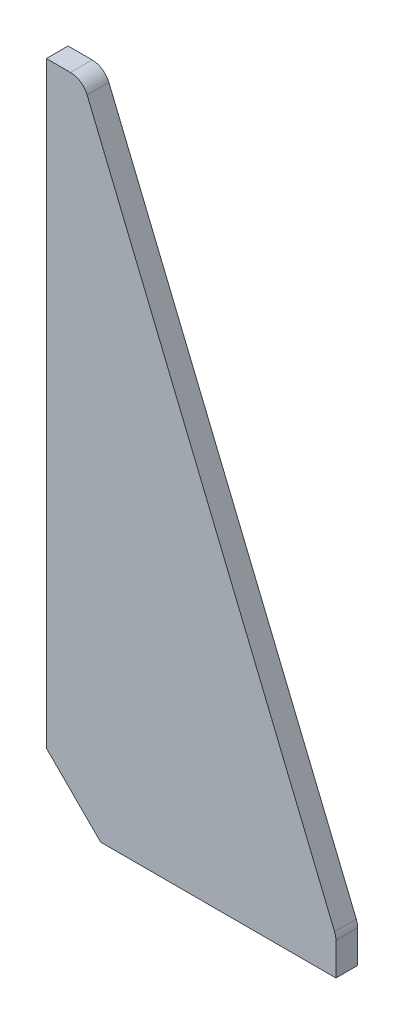
ISO-10303-21;
HEADER;
FILE_DESCRIPTION(('STEP AP214'),'2;1');
FILE_NAME('part.step','',(''),(''),'','','');
FILE_SCHEMA(('AUTOMOTIVE_DESIGN { 1 0 10303 214 1 1 1 1 }'));
ENDSEC;
DATA;
#1=APPLICATION_CONTEXT('core data for automotive mechanical design processes');
#2=APPLICATION_PROTOCOL_DEFINITION('international standard','automotive_design',2000,#1);
#3=PRODUCT_CONTEXT('',#1,'mechanical');
#4=PRODUCT('Part','Part','',(#3));
#5=PRODUCT_RELATED_PRODUCT_CATEGORY('part','',(#4));
#6=PRODUCT_DEFINITION_FORMATION('','',#4);
#7=PRODUCT_DEFINITION_CONTEXT('part definition',#1,'design');
#8=PRODUCT_DEFINITION('design','',#6,#7);
#9=PRODUCT_DEFINITION_SHAPE('','',#8);
#10=(LENGTH_UNIT() NAMED_UNIT(*) SI_UNIT(.MILLI.,.METRE.));
#11=(NAMED_UNIT(*) PLANE_ANGLE_UNIT() SI_UNIT($,.RADIAN.));
#12=(NAMED_UNIT(*) SI_UNIT($,.STERADIAN.) SOLID_ANGLE_UNIT());
#13=UNCERTAINTY_MEASURE_WITH_UNIT(LENGTH_MEASURE(1.E-05),#10,'distance_accuracy_value','');
#14=(GEOMETRIC_REPRESENTATION_CONTEXT(3) GLOBAL_UNCERTAINTY_ASSIGNED_CONTEXT((#13)) GLOBAL_UNIT_ASSIGNED_CONTEXT((#10,
#11,#12)) REPRESENTATION_CONTEXT('',''));
#15=CARTESIAN_POINT('',(0.,0.,0.));
#16=DIRECTION('',(0.,0.,1.));
#17=DIRECTION('',(1.,0.,0.));
#18=AXIS2_PLACEMENT_3D('',#15,#16,#17);
#19=CARTESIAN_POINT('',(796.,181.7,-3.));
#20=DIRECTION('',(0.,1.,0.));
#21=DIRECTION('',(0.,0.,1.));
#22=AXIS2_PLACEMENT_3D('',#19,#20,#21);
#23=PLANE('',#22);
#24=DIRECTION('',(-1.,0.,0.));
#25=VECTOR('',#24,1.);
#26=CARTESIAN_POINT('',(796.,181.7,3.));
#27=LINE('',#26,#25);
#28=CARTESIAN_POINT('',(792.651536379162,181.7,3.));
#29=VERTEX_POINT('',#28);
#30=CARTESIAN_POINT('',(786.,181.7,3.));
#31=VERTEX_POINT('',#30);
#32=EDGE_CURVE('E105',#29,#31,#27,.T.);
#33=ORIENTED_EDGE('',*,*,#32,.F.);
#34=DIRECTION('',(0.,0.,1.));
#35=VECTOR('',#34,1.);
#36=CARTESIAN_POINT('',(792.651536379162,181.7,-3.));
#37=LINE('',#36,#35);
#38=CARTESIAN_POINT('',(792.651536379162,181.7,-3.));
#39=VERTEX_POINT('',#38);
#40=EDGE_CURVE('E11',#29,#39,#37,.F.);
#41=ORIENTED_EDGE('',*,*,#40,.T.);
#42=DIRECTION('',(-1.,0.,0.));
#43=VECTOR('',#42,1.);
#44=CARTESIAN_POINT('',(796.,181.7,-3.));
#45=LINE('',#44,#43);
#46=CARTESIAN_POINT('',(786.,181.7,-3.));
#47=VERTEX_POINT('',#46);
#48=EDGE_CURVE('E118',#39,#47,#45,.T.);
#49=ORIENTED_EDGE('',*,*,#48,.T.);
#50=DIRECTION('',(0.,0.,1.));
#51=VECTOR('',#50,1.);
#52=CARTESIAN_POINT('',(786.,181.7,-3.));
#53=LINE('',#52,#51);
#54=EDGE_CURVE('E117',#47,#31,#53,.T.);
#55=ORIENTED_EDGE('',*,*,#54,.T.);
#56=EDGE_LOOP('',(#33,#41,#49,#55));
#57=FACE_BOUND('',#56,.T.);
#58=ADVANCED_FACE('F41',(#57),#23,.T.);
#59=CARTESIAN_POINT('',(866.,11.6999999999996,-3.));
#60=DIRECTION('',(0.924678098474716,0.380749805254294,0.));
#61=DIRECTION('',(-0.380749805254294,0.924678098474716,0.));
#62=AXIS2_PLACEMENT_3D('',#59,#60,#61);
#63=PLANE('',#62);
#64=DIRECTION('',(-0.380749805254294,0.924678098474716,0.));
#65=VECTOR('',#64,1.);
#66=CARTESIAN_POINT('',(866.,11.6999999999996,3.));
#67=LINE('',#66,#65);
#68=CARTESIAN_POINT('',(865.623390492374,12.6146230899495,3.));
#69=VERTEX_POINT('',#68);
#70=CARTESIAN_POINT('',(797.274926871536,178.603749026271,3.));
#71=VERTEX_POINT('',#70);
#72=EDGE_CURVE('E135',#69,#71,#67,.T.);
#73=ORIENTED_EDGE('',*,*,#72,.F.);
#74=DIRECTION('',(0.,0.,1.));
#75=VECTOR('',#74,1.);
#76=CARTESIAN_POINT('',(865.623390492374,12.6146230899494,-3.));
#77=LINE('',#76,#75);
#78=CARTESIAN_POINT('',(865.623390492374,12.6146230899495,-3.));
#79=VERTEX_POINT('',#78);
#80=EDGE_CURVE('E164',#69,#79,#77,.F.);
#81=ORIENTED_EDGE('',*,*,#80,.T.);
#82=DIRECTION('',(-0.380749805254294,0.924678098474716,0.));
#83=VECTOR('',#82,1.);
#84=CARTESIAN_POINT('',(866.,11.6999999999996,-3.));
#85=LINE('',#84,#83);
#86=CARTESIAN_POINT('',(797.274926871536,178.603749026271,-3.));
#87=VERTEX_POINT('',#86);
#88=EDGE_CURVE('E123',#79,#87,#85,.T.);
#89=ORIENTED_EDGE('',*,*,#88,.T.);
#90=DIRECTION('',(0.,0.,1.));
#91=VECTOR('',#90,1.);
#92=CARTESIAN_POINT('',(797.274926871536,178.603749026271,-3.));
#93=LINE('',#92,#91);
#94=EDGE_CURVE('E161',#87,#71,#93,.T.);
#95=ORIENTED_EDGE('',*,*,#94,.T.);
#96=EDGE_LOOP('',(#73,#81,#89,#95));
#97=FACE_BOUND('',#96,.T.);
#98=ADVANCED_FACE('F179',(#97),#63,.T.);
#99=CARTESIAN_POINT('',(866.,1.6999999999996,-3.));
#100=DIRECTION('',(1.,0.,0.));
#101=DIRECTION('',(0.,1.,0.));
#102=AXIS2_PLACEMENT_3D('',#99,#100,#101);
#103=PLANE('',#102);
#104=DIRECTION('',(0.,1.,0.));
#105=VECTOR('',#104,1.);
#106=CARTESIAN_POINT('',(866.,1.6999999999996,-3.));
#107=LINE('',#106,#105);
#108=CARTESIAN_POINT('',(866.,1.6999999999996,-3.));
#109=VERTEX_POINT('',#108);
#110=CARTESIAN_POINT('',(866.,10.710874063678,-3.));
#111=VERTEX_POINT('',#110);
#112=EDGE_CURVE('E146',#109,#111,#107,.T.);
#113=ORIENTED_EDGE('',*,*,#112,.T.);
#114=DIRECTION('',(0.,0.,1.));
#115=VECTOR('',#114,1.);
#116=CARTESIAN_POINT('',(866.,10.710874063678,-3.));
#117=LINE('',#116,#115);
#118=CARTESIAN_POINT('',(866.,10.710874063678,3.));
#119=VERTEX_POINT('',#118);
#120=EDGE_CURVE('E152',#111,#119,#117,.T.);
#121=ORIENTED_EDGE('',*,*,#120,.T.);
#122=DIRECTION('',(0.,1.,0.));
#123=VECTOR('',#122,1.);
#124=CARTESIAN_POINT('',(866.,1.6999999999996,3.));
#125=LINE('',#124,#123);
#126=CARTESIAN_POINT('',(866.,1.6999999999996,3.));
#127=VERTEX_POINT('',#126);
#128=EDGE_CURVE('E133',#127,#119,#125,.T.);
#129=ORIENTED_EDGE('',*,*,#128,.F.);
#130=DIRECTION('',(0.,0.,1.));
#131=VECTOR('',#130,1.);
#132=CARTESIAN_POINT('',(866.,1.6999999999996,-3.));
#133=LINE('',#132,#131);
#134=EDGE_CURVE('E150',#109,#127,#133,.T.);
#135=ORIENTED_EDGE('',*,*,#134,.F.);
#136=EDGE_LOOP('',(#113,#121,#129,#135));
#137=FACE_BOUND('',#136,.T.);
#138=ADVANCED_FACE('F174',(#137),#103,.T.);
#139=CARTESIAN_POINT('',(801.,1.6999999999996,-3.));
#140=DIRECTION('',(0.,-1.,0.));
#141=DIRECTION('',(0.,0.,-1.));
#142=AXIS2_PLACEMENT_3D('',#139,#140,#141);
#143=PLANE('',#142);
#144=ORIENTED_EDGE('',*,*,#134,.T.);
#145=DIRECTION('',(1.,0.,0.));
#146=VECTOR('',#145,1.);
#147=CARTESIAN_POINT('',(801.,1.6999999999996,3.));
#148=LINE('',#147,#146);
#149=CARTESIAN_POINT('',(801.,1.6999999999996,3.));
#150=VERTEX_POINT('',#149);
#151=EDGE_CURVE('E128',#150,#127,#148,.T.);
#152=ORIENTED_EDGE('',*,*,#151,.F.);
#153=DIRECTION('',(0.,0.,1.));
#154=VECTOR('',#153,1.);
#155=CARTESIAN_POINT('',(801.,1.6999999999996,-3.));
#156=LINE('',#155,#154);
#157=CARTESIAN_POINT('',(801.,1.6999999999996,-3.));
#158=VERTEX_POINT('',#157);
#159=EDGE_CURVE('E153',#158,#150,#156,.T.);
#160=ORIENTED_EDGE('',*,*,#159,.F.);
#161=DIRECTION('',(1.,0.,0.));
#162=VECTOR('',#161,1.);
#163=CARTESIAN_POINT('',(801.,1.6999999999996,-3.));
#164=LINE('',#163,#162);
#165=EDGE_CURVE('E143',#158,#109,#164,.T.);
#166=ORIENTED_EDGE('',*,*,#165,.T.);
#167=EDGE_LOOP('',(#144,#152,#160,#166));
#168=FACE_BOUND('',#167,.T.);
#169=ADVANCED_FACE('F199',(#168),#143,.T.);
#170=CARTESIAN_POINT('',(786.,16.6999999999997,-3.));
#171=DIRECTION('',(-0.707106781186548,-0.707106781186547,0.));
#172=DIRECTION('',(0.707106781186547,-0.707106781186548,0.));
#173=AXIS2_PLACEMENT_3D('',#170,#171,#172);
#174=PLANE('',#173);
#175=ORIENTED_EDGE('',*,*,#159,.T.);
#176=DIRECTION('',(0.707106781186547,-0.707106781186548,0.));
#177=VECTOR('',#176,1.);
#178=CARTESIAN_POINT('',(786.,16.6999999999997,3.));
#179=LINE('',#178,#177);
#180=CARTESIAN_POINT('',(786.,16.6999999999997,3.));
#181=VERTEX_POINT('',#180);
#182=EDGE_CURVE('E126',#181,#150,#179,.T.);
#183=ORIENTED_EDGE('',*,*,#182,.F.);
#184=DIRECTION('',(0.,0.,1.));
#185=VECTOR('',#184,1.);
#186=CARTESIAN_POINT('',(786.,16.6999999999997,-3.));
#187=LINE('',#186,#185);
#188=CARTESIAN_POINT('',(786.,16.6999999999997,-3.));
#189=VERTEX_POINT('',#188);
#190=EDGE_CURVE('E122',#189,#181,#187,.T.);
#191=ORIENTED_EDGE('',*,*,#190,.F.);
#192=DIRECTION('',(0.707106781186547,-0.707106781186548,0.));
#193=VECTOR('',#192,1.);
#194=CARTESIAN_POINT('',(786.,16.6999999999997,-3.));
#195=LINE('',#194,#193);
#196=EDGE_CURVE('E140',#189,#158,#195,.T.);
#197=ORIENTED_EDGE('',*,*,#196,.T.);
#198=EDGE_LOOP('',(#175,#183,#191,#197));
#199=FACE_BOUND('',#198,.T.);
#200=ADVANCED_FACE('F196',(#199),#174,.T.);
#201=CARTESIAN_POINT('',(786.,181.7,-3.));
#202=DIRECTION('',(-1.,0.,0.));
#203=DIRECTION('',(0.,0.,1.));
#204=AXIS2_PLACEMENT_3D('',#201,#202,#203);
#205=PLANE('',#204);
#206=ORIENTED_EDGE('',*,*,#190,.T.);
#207=DIRECTION('',(0.,-1.,0.));
#208=VECTOR('',#207,1.);
#209=CARTESIAN_POINT('',(786.,181.7,3.));
#210=LINE('',#209,#208);
#211=EDGE_CURVE('E111',#31,#181,#210,.T.);
#212=ORIENTED_EDGE('',*,*,#211,.F.);
#213=ORIENTED_EDGE('',*,*,#54,.F.);
#214=DIRECTION('',(0.,-1.,0.));
#215=VECTOR('',#214,1.);
#216=CARTESIAN_POINT('',(786.,181.7,-3.));
#217=LINE('',#216,#215);
#218=EDGE_CURVE('E138',#47,#189,#217,.T.);
#219=ORIENTED_EDGE('',*,*,#218,.T.);
#220=EDGE_LOOP('',(#206,#212,#213,#219));
#221=FACE_BOUND('',#220,.T.);
#222=ADVANCED_FACE('F125',(#221),#205,.T.);
#223=CARTESIAN_POINT('',(0.,0.,-3.));
#224=DIRECTION('',(0.,0.,1.));
#225=DIRECTION('',(1.,0.,0.));
#226=AXIS2_PLACEMENT_3D('',#223,#224,#225);
#227=PLANE('',#226);
#228=ORIENTED_EDGE('',*,*,#88,.F.);
#229=CARTESIAN_POINT('',(861.,10.710874063678,-3.));
#230=DIRECTION('',(0.,0.,1.));
#231=DIRECTION('',(1.,0.,0.));
#232=AXIS2_PLACEMENT_3D('',#229,#230,#231);
#233=CIRCLE('',#232,5.);
#234=EDGE_CURVE('E49',#79,#111,#233,.F.);
#235=ORIENTED_EDGE('',*,*,#234,.T.);
#236=ORIENTED_EDGE('',*,*,#112,.F.);
#237=ORIENTED_EDGE('',*,*,#165,.F.);
#238=ORIENTED_EDGE('',*,*,#196,.F.);
#239=ORIENTED_EDGE('',*,*,#218,.F.);
#240=ORIENTED_EDGE('',*,*,#48,.F.);
#241=CARTESIAN_POINT('',(792.651536379162,176.7,-3.));
#242=DIRECTION('',(0.,0.,1.));
#243=DIRECTION('',(1.,0.,0.));
#244=AXIS2_PLACEMENT_3D('',#241,#242,#243);
#245=CIRCLE('',#244,5.);
#246=EDGE_CURVE('E61',#39,#87,#245,.F.);
#247=ORIENTED_EDGE('',*,*,#246,.T.);
#248=EDGE_LOOP('',(#228,#235,#236,#237,#238,#239,#240,#247));
#249=FACE_BOUND('',#248,.T.);
#250=ADVANCED_FACE('F168',(#249),#227,.F.);
#251=CARTESIAN_POINT('',(0.,0.,3.));
#252=DIRECTION('',(0.,0.,1.));
#253=DIRECTION('',(1.,0.,0.));
#254=AXIS2_PLACEMENT_3D('',#251,#252,#253);
#255=PLANE('',#254);
#256=ORIENTED_EDGE('',*,*,#128,.T.);
#257=CARTESIAN_POINT('',(861.,10.710874063678,3.));
#258=DIRECTION('',(0.,0.,1.));
#259=DIRECTION('',(1.,0.,0.));
#260=AXIS2_PLACEMENT_3D('',#257,#258,#259);
#261=CIRCLE('',#260,5.);
#262=EDGE_CURVE('E159',#119,#69,#261,.T.);
#263=ORIENTED_EDGE('',*,*,#262,.T.);
#264=ORIENTED_EDGE('',*,*,#72,.T.);
#265=CARTESIAN_POINT('',(792.651536379162,176.7,3.));
#266=DIRECTION('',(0.,0.,1.));
#267=DIRECTION('',(1.,0.,0.));
#268=AXIS2_PLACEMENT_3D('',#265,#266,#267);
#269=CIRCLE('',#268,5.);
#270=EDGE_CURVE('E114',#71,#29,#269,.T.);
#271=ORIENTED_EDGE('',*,*,#270,.T.);
#272=ORIENTED_EDGE('',*,*,#32,.T.);
#273=ORIENTED_EDGE('',*,*,#211,.T.);
#274=ORIENTED_EDGE('',*,*,#182,.T.);
#275=ORIENTED_EDGE('',*,*,#151,.T.);
#276=EDGE_LOOP('',(#256,#263,#264,#271,#272,#273,#274,#275));
#277=FACE_BOUND('',#276,.T.);
#278=ADVANCED_FACE('F108',(#277),#255,.T.);
#279=CARTESIAN_POINT('',(861.,10.710874063678,-3.));
#280=DIRECTION('',(0.,0.,1.));
#281=DIRECTION('',(1.,0.,0.));
#282=AXIS2_PLACEMENT_3D('',#279,#280,#281);
#283=CYLINDRICAL_SURFACE('',#282,5.);
#284=ORIENTED_EDGE('',*,*,#234,.F.);
#285=ORIENTED_EDGE('',*,*,#80,.F.);
#286=ORIENTED_EDGE('',*,*,#262,.F.);
#287=ORIENTED_EDGE('',*,*,#120,.F.);
#288=EDGE_LOOP('',(#284,#285,#286,#287));
#289=FACE_BOUND('',#288,.T.);
#290=ADVANCED_FACE('F176',(#289),#283,.T.);
#291=CARTESIAN_POINT('',(792.651536379162,176.7,-3.));
#292=DIRECTION('',(0.,0.,1.));
#293=DIRECTION('',(1.,0.,0.));
#294=AXIS2_PLACEMENT_3D('',#291,#292,#293);
#295=CYLINDRICAL_SURFACE('',#294,5.);
#296=ORIENTED_EDGE('',*,*,#246,.F.);
#297=ORIENTED_EDGE('',*,*,#40,.F.);
#298=ORIENTED_EDGE('',*,*,#270,.F.);
#299=ORIENTED_EDGE('',*,*,#94,.F.);
#300=EDGE_LOOP('',(#296,#297,#298,#299));
#301=FACE_BOUND('',#300,.T.);
#302=ADVANCED_FACE('F43',(#301),#295,.T.);
#303=CLOSED_SHELL('',(#58,#98,#138,#169,#200,#222,#250,#278,#290,#302));
#304=MANIFOLD_SOLID_BREP('B2',#303);
#305=ADVANCED_BREP_SHAPE_REPRESENTATION('',(#18,#304),#14);
#306=SHAPE_DEFINITION_REPRESENTATION(#9,#305);
ENDSEC;
END-ISO-10303-21;
